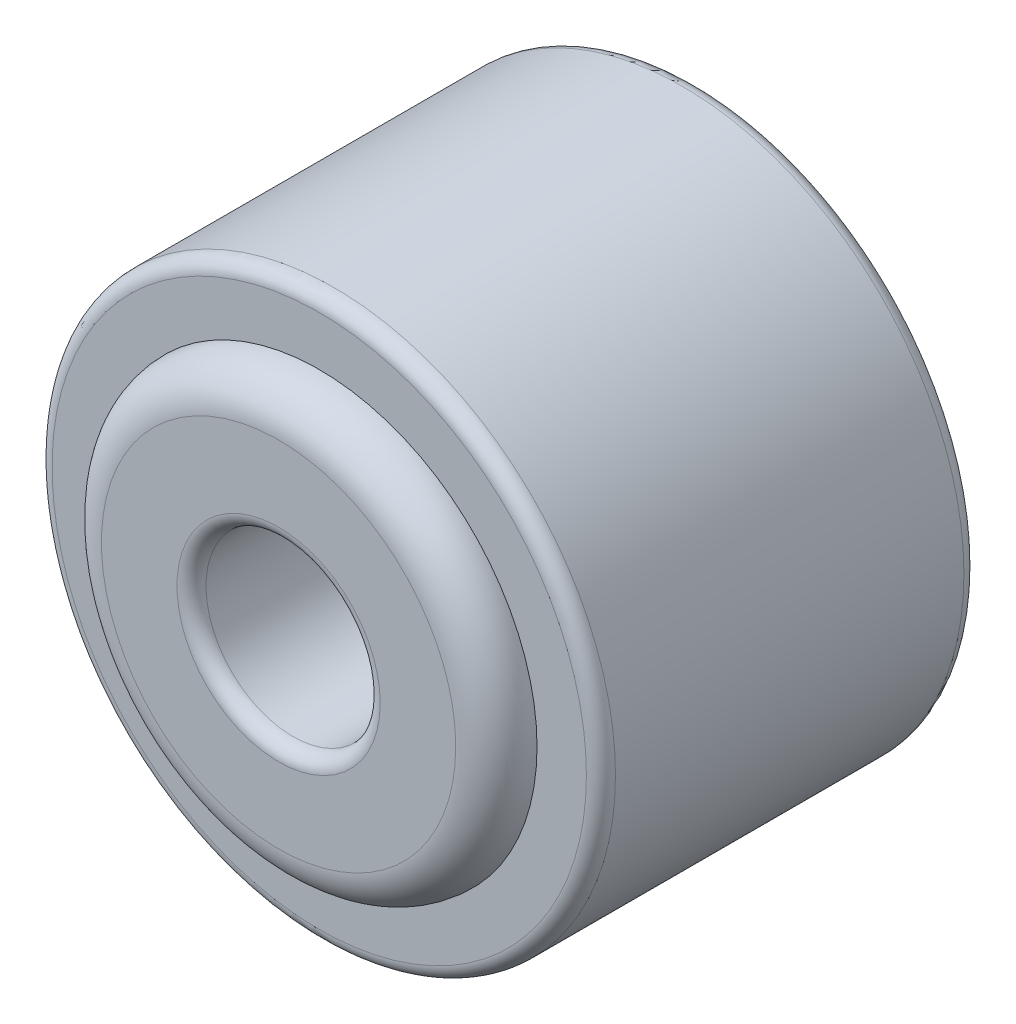
ISO-10303-21;
HEADER;
FILE_DESCRIPTION(('STEP AP214'),'2;1');
FILE_NAME('part.step','',(''),(''),'','','');
FILE_SCHEMA(('AUTOMOTIVE_DESIGN { 1 0 10303 214 1 1 1 1 }'));
ENDSEC;
DATA;
#1=APPLICATION_CONTEXT('core data for automotive mechanical design processes');
#2=APPLICATION_PROTOCOL_DEFINITION('international standard','automotive_design',2000,#1);
#3=PRODUCT_CONTEXT('',#1,'mechanical');
#4=PRODUCT('Part','Part','',(#3));
#5=PRODUCT_RELATED_PRODUCT_CATEGORY('part','',(#4));
#6=PRODUCT_DEFINITION_FORMATION('','',#4);
#7=PRODUCT_DEFINITION_CONTEXT('part definition',#1,'design');
#8=PRODUCT_DEFINITION('design','',#6,#7);
#9=PRODUCT_DEFINITION_SHAPE('','',#8);
#10=(LENGTH_UNIT() NAMED_UNIT(*) SI_UNIT(.MILLI.,.METRE.));
#11=(NAMED_UNIT(*) PLANE_ANGLE_UNIT() SI_UNIT($,.RADIAN.));
#12=(NAMED_UNIT(*) SI_UNIT($,.STERADIAN.) SOLID_ANGLE_UNIT());
#13=UNCERTAINTY_MEASURE_WITH_UNIT(LENGTH_MEASURE(1.E-05),#10,'distance_accuracy_value','');
#14=(GEOMETRIC_REPRESENTATION_CONTEXT(3) GLOBAL_UNCERTAINTY_ASSIGNED_CONTEXT((#13)) GLOBAL_UNIT_ASSIGNED_CONTEXT((#10,
#11,#12)) REPRESENTATION_CONTEXT('',''));
#15=CARTESIAN_POINT('',(0.,0.,0.));
#16=DIRECTION('',(0.,0.,1.));
#17=DIRECTION('',(1.,0.,0.));
#18=AXIS2_PLACEMENT_3D('',#15,#16,#17);
#19=CARTESIAN_POINT('',(0.,0.,1.625));
#20=DIRECTION('',(0.,0.,1.));
#21=DIRECTION('',(1.,0.,0.));
#22=AXIS2_PLACEMENT_3D('',#19,#20,#21);
#23=PLANE('',#22);
#24=CARTESIAN_POINT('',(0.,0.,1.625));
#25=DIRECTION('',(0.,0.,1.));
#26=DIRECTION('',(1.,0.,0.));
#27=AXIS2_PLACEMENT_3D('',#24,#25,#26);
#28=CIRCLE('',#27,2.3);
#29=CARTESIAN_POINT('',(2.3,0.,1.625));
#30=VERTEX_POINT('',#29);
#31=EDGE_CURVE('E10',#30,#30,#28,.T.);
#32=ORIENTED_EDGE('',*,*,#31,.T.);
#33=EDGE_LOOP('',(#32));
#34=FACE_BOUND('',#33,.T.);
#35=CARTESIAN_POINT('',(0.,0.,1.625));
#36=DIRECTION('',(0.,0.,1.));
#37=DIRECTION('',(1.,0.,0.));
#38=AXIS2_PLACEMENT_3D('',#35,#36,#37);
#39=CIRCLE('',#38,1.875);
#40=CARTESIAN_POINT('',(1.875,0.,1.625));
#41=VERTEX_POINT('',#40);
#42=EDGE_CURVE('E70',#41,#41,#39,.T.);
#43=ORIENTED_EDGE('',*,*,#42,.F.);
#44=EDGE_LOOP('',(#43));
#45=FACE_BOUND('',#44,.T.);
#46=ADVANCED_FACE('F32',(#34,#45),#23,.T.);
#47=CARTESIAN_POINT('',(0.,0.,1.625));
#48=DIRECTION('',(0.,0.,-1.));
#49=DIRECTION('',(-1.,0.,0.));
#50=AXIS2_PLACEMENT_3D('',#47,#48,#49);
#51=CYLINDRICAL_SURFACE('',#50,2.425);
#52=CARTESIAN_POINT('',(0.,0.,-1.5));
#53=DIRECTION('',(0.,0.,1.));
#54=DIRECTION('',(1.,0.,0.));
#55=AXIS2_PLACEMENT_3D('',#52,#53,#54);
#56=CIRCLE('',#55,2.425);
#57=CARTESIAN_POINT('',(-2.425,0.,-1.5));
#58=VERTEX_POINT('',#57);
#59=EDGE_CURVE('E43',#58,#58,#56,.T.);
#60=CARTESIAN_POINT('',(0.,0.,1.5));
#61=DIRECTION('',(0.,0.,1.));
#62=DIRECTION('',(1.,0.,0.));
#63=AXIS2_PLACEMENT_3D('',#60,#61,#62);
#64=CIRCLE('',#63,2.425);
#65=CARTESIAN_POINT('',(-2.425,0.,1.5));
#66=VERTEX_POINT('',#65);
#67=EDGE_CURVE('E47',#66,#66,#64,.F.);
#68=CARTESIAN_POINT('',(-2.425,0.,-1.5));
#69=CARTESIAN_POINT('',(-2.425,0.,-1.46875));
#70=CARTESIAN_POINT('',(-2.425,0.,-1.4375));
#71=CARTESIAN_POINT('',(-2.425,0.,-1.375));
#72=CARTESIAN_POINT('',(-2.425,0.,-1.34375));
#73=CARTESIAN_POINT('',(-2.425,0.,-1.28125));
#74=CARTESIAN_POINT('',(-2.425,0.,-1.25));
#75=CARTESIAN_POINT('',(-2.425,0.,-1.1875));
#76=CARTESIAN_POINT('',(-2.425,0.,-1.15625));
#77=CARTESIAN_POINT('',(-2.425,0.,-1.09375));
#78=CARTESIAN_POINT('',(-2.425,0.,-1.0625));
#79=CARTESIAN_POINT('',(-2.425,0.,-1.));
#80=CARTESIAN_POINT('',(-2.425,0.,-0.968750000000001));
#81=CARTESIAN_POINT('',(-2.425,0.,-0.906250000000001));
#82=CARTESIAN_POINT('',(-2.425,0.,-0.875000000000001));
#83=CARTESIAN_POINT('',(-2.425,0.,-0.812500000000001));
#84=CARTESIAN_POINT('',(-2.425,0.,-0.78125));
#85=CARTESIAN_POINT('',(-2.425,0.,-0.71875));
#86=CARTESIAN_POINT('',(-2.425,0.,-0.6875));
#87=CARTESIAN_POINT('',(-2.425,0.,-0.625));
#88=CARTESIAN_POINT('',(-2.425,0.,-0.59375));
#89=CARTESIAN_POINT('',(-2.425,0.,-0.53125));
#90=CARTESIAN_POINT('',(-2.425,0.,-0.500000000000001));
#91=CARTESIAN_POINT('',(-2.425,0.,-0.437500000000001));
#92=CARTESIAN_POINT('',(-2.425,0.,-0.406250000000001));
#93=CARTESIAN_POINT('',(-2.425,0.,-0.34375));
#94=CARTESIAN_POINT('',(-2.425,0.,-0.3125));
#95=CARTESIAN_POINT('',(-2.425,0.,-0.25));
#96=CARTESIAN_POINT('',(-2.425,0.,-0.218750000000001));
#97=CARTESIAN_POINT('',(-2.425,0.,-0.156250000000001));
#98=CARTESIAN_POINT('',(-2.425,0.,-0.125000000000001));
#99=CARTESIAN_POINT('',(-2.425,0.,-0.0625000000000005));
#100=CARTESIAN_POINT('',(-2.425,0.,-0.0312500000000005));
#101=CARTESIAN_POINT('',(-2.425,0.,0.0312499999999996));
#102=CARTESIAN_POINT('',(-2.425,0.,0.0624999999999996));
#103=CARTESIAN_POINT('',(-2.425,0.,0.125));
#104=CARTESIAN_POINT('',(-2.425,0.,0.15625));
#105=CARTESIAN_POINT('',(-2.425,0.,0.21875));
#106=CARTESIAN_POINT('',(-2.425,0.,0.25));
#107=CARTESIAN_POINT('',(-2.425,0.,0.3125));
#108=CARTESIAN_POINT('',(-2.425,0.,0.34375));
#109=CARTESIAN_POINT('',(-2.425,0.,0.40625));
#110=CARTESIAN_POINT('',(-2.425,0.,0.4375));
#111=CARTESIAN_POINT('',(-2.425,0.,0.5));
#112=CARTESIAN_POINT('',(-2.425,0.,0.53125));
#113=CARTESIAN_POINT('',(-2.425,0.,0.59375));
#114=CARTESIAN_POINT('',(-2.425,0.,0.625));
#115=CARTESIAN_POINT('',(-2.425,0.,0.6875));
#116=CARTESIAN_POINT('',(-2.425,0.,0.71875));
#117=CARTESIAN_POINT('',(-2.425,0.,0.78125));
#118=CARTESIAN_POINT('',(-2.425,0.,0.8125));
#119=CARTESIAN_POINT('',(-2.425,0.,0.875));
#120=CARTESIAN_POINT('',(-2.425,0.,0.90625));
#121=CARTESIAN_POINT('',(-2.425,0.,0.96875));
#122=CARTESIAN_POINT('',(-2.425,0.,1.));
#123=CARTESIAN_POINT('',(-2.425,0.,1.0625));
#124=CARTESIAN_POINT('',(-2.425,0.,1.09375));
#125=CARTESIAN_POINT('',(-2.425,0.,1.15625));
#126=CARTESIAN_POINT('',(-2.425,0.,1.1875));
#127=CARTESIAN_POINT('',(-2.425,0.,1.25));
#128=CARTESIAN_POINT('',(-2.425,0.,1.28125));
#129=CARTESIAN_POINT('',(-2.425,0.,1.34375));
#130=CARTESIAN_POINT('',(-2.425,0.,1.375));
#131=CARTESIAN_POINT('',(-2.425,0.,1.4375));
#132=CARTESIAN_POINT('',(-2.425,0.,1.46875));
#133=CARTESIAN_POINT('',(-2.425,0.,1.5));
#134=B_SPLINE_CURVE_WITH_KNOTS('',3,(#68,#69,#70,#71,#72,#73,#74,#75,#76,#77,#78,#79,#80,#81,
#82,#83,#84,#85,#86,#87,#88,#89,#90,#91,#92,#93,#94,#95,#96,#97,#98,#99,#100,#101,#102,#103,
#104,#105,#106,#107,#108,#109,#110,#111,#112,#113,#114,#115,#116,#117,#118,#119,#120,#121,#122,
#123,#124,#125,#126,#127,#128,#129,#130,#131,#132,#133),.UNSPECIFIED.,.F.,.F.,(4,2,2,2,2,2,2,2,
2,2,2,2,2,2,2,2,2,2,2,2,2,2,2,2,2,2,2,2,2,2,2,2,4),(0.,0.0937500000000001,0.1875,0.28125,0.375,
0.46875,0.5625,0.65625,0.75,0.84375,0.9375,1.03125,1.125,1.21875,1.3125,1.40625,1.5,1.59375,
1.6875,1.78125,1.875,1.96875,2.0625,2.15625,2.25,2.34375,2.4375,2.53125,2.625,2.71875,2.8125,
2.90625,3.),.UNSPECIFIED.);
#135=EDGE_CURVE('BSEAM98',#58,#66,#134,.T.);
#136=ORIENTED_EDGE('',*,*,#59,.T.);
#137=ORIENTED_EDGE('',*,*,#67,.T.);
#138=ORIENTED_EDGE('',*,*,#135,.T.);
#139=ORIENTED_EDGE('',*,*,#135,.F.);
#140=EDGE_LOOP('',(#136,#138,#137,#139));
#141=FACE_BOUND('',#140,.T.);
#142=ADVANCED_FACE('F98',(#141),#51,.T.);
#143=CARTESIAN_POINT('',(0.,0.,-1.625));
#144=DIRECTION('',(0.,0.,1.));
#145=DIRECTION('',(1.,0.,0.));
#146=AXIS2_PLACEMENT_3D('',#143,#144,#145);
#147=PLANE('',#146);
#148=CARTESIAN_POINT('',(0.,0.,-1.625));
#149=DIRECTION('',(0.,0.,1.));
#150=DIRECTION('',(1.,0.,0.));
#151=AXIS2_PLACEMENT_3D('',#148,#149,#150);
#152=CIRCLE('',#151,2.3);
#153=CARTESIAN_POINT('',(2.3,0.,-1.625));
#154=VERTEX_POINT('',#153);
#155=EDGE_CURVE('E39',#154,#154,#152,.F.);
#156=ORIENTED_EDGE('',*,*,#155,.T.);
#157=EDGE_LOOP('',(#156));
#158=FACE_BOUND('',#157,.T.);
#159=CARTESIAN_POINT('',(0.,0.,-1.625));
#160=DIRECTION('',(0.,0.,1.));
#161=DIRECTION('',(1.,0.,0.));
#162=AXIS2_PLACEMENT_3D('',#159,#160,#161);
#163=CIRCLE('',#162,1.875);
#164=CARTESIAN_POINT('',(1.875,0.,-1.625));
#165=VERTEX_POINT('',#164);
#166=EDGE_CURVE('E73',#165,#165,#163,.T.);
#167=ORIENTED_EDGE('',*,*,#166,.T.);
#168=EDGE_LOOP('',(#167));
#169=FACE_BOUND('',#168,.T.);
#170=ADVANCED_FACE('F77',(#158,#169),#147,.F.);
#171=CARTESIAN_POINT('',(0.,0.,1.975));
#172=DIRECTION('',(0.,0.,1.));
#173=DIRECTION('',(1.,0.,0.));
#174=AXIS2_PLACEMENT_3D('',#171,#172,#173);
#175=PLANE('',#174);
#176=CARTESIAN_POINT('',(0.,0.,1.975));
#177=DIRECTION('',(0.,0.,1.));
#178=DIRECTION('',(1.,0.,0.));
#179=AXIS2_PLACEMENT_3D('',#176,#177,#178);
#180=CIRCLE('',#179,0.875);
#181=CARTESIAN_POINT('',(0.875,0.,1.975));
#182=VERTEX_POINT('',#181);
#183=EDGE_CURVE('E52',#182,#182,#180,.F.);
#184=ORIENTED_EDGE('',*,*,#183,.T.);
#185=EDGE_LOOP('',(#184));
#186=FACE_BOUND('',#185,.T.);
#187=CARTESIAN_POINT('',(0.,0.,1.975));
#188=DIRECTION('',(0.,0.,1.));
#189=DIRECTION('',(1.,0.,0.));
#190=AXIS2_PLACEMENT_3D('',#187,#188,#189);
#191=CIRCLE('',#190,1.525);
#192=CARTESIAN_POINT('',(1.525,0.,1.975));
#193=VERTEX_POINT('',#192);
#194=EDGE_CURVE('E64',#193,#193,#191,.T.);
#195=ORIENTED_EDGE('',*,*,#194,.T.);
#196=EDGE_LOOP('',(#195));
#197=FACE_BOUND('',#196,.T.);
#198=ADVANCED_FACE('F92',(#186,#197),#175,.T.);
#199=CARTESIAN_POINT('',(0.,0.,-1.975));
#200=DIRECTION('',(0.,0.,-1.));
#201=DIRECTION('',(1.,0.,0.));
#202=AXIS2_PLACEMENT_3D('',#199,#200,#201);
#203=PLANE('',#202);
#204=CARTESIAN_POINT('',(0.,0.,-1.975));
#205=DIRECTION('',(0.,0.,-1.));
#206=DIRECTION('',(-1.,0.,0.));
#207=AXIS2_PLACEMENT_3D('',#204,#205,#206);
#208=CIRCLE('',#207,0.875);
#209=CARTESIAN_POINT('',(-0.875,0.,-1.975));
#210=VERTEX_POINT('',#209);
#211=EDGE_CURVE('E61',#210,#210,#208,.F.);
#212=ORIENTED_EDGE('',*,*,#211,.T.);
#213=EDGE_LOOP('',(#212));
#214=FACE_BOUND('',#213,.T.);
#215=CARTESIAN_POINT('',(0.,0.,-1.975));
#216=DIRECTION('',(0.,0.,-1.));
#217=DIRECTION('',(-1.,0.,0.));
#218=AXIS2_PLACEMENT_3D('',#215,#216,#217);
#219=CIRCLE('',#218,1.525);
#220=CARTESIAN_POINT('',(-1.525,0.,-1.975));
#221=VERTEX_POINT('',#220);
#222=EDGE_CURVE('E67',#221,#221,#219,.T.);
#223=ORIENTED_EDGE('',*,*,#222,.T.);
#224=EDGE_LOOP('',(#223));
#225=FACE_BOUND('',#224,.T.);
#226=ADVANCED_FACE('F82',(#214,#225),#203,.T.);
#227=CARTESIAN_POINT('',(0.,0.,-1.625));
#228=DIRECTION('',(0.,0.,-1.));
#229=DIRECTION('',(-1.,0.,0.));
#230=AXIS2_PLACEMENT_3D('',#227,#228,#229);
#231=TOROIDAL_SURFACE('',#230,1.525,0.35);
#232=ORIENTED_EDGE('',*,*,#222,.F.);
#233=EDGE_LOOP('',(#232));
#234=FACE_BOUND('',#233,.T.);
#235=ORIENTED_EDGE('',*,*,#166,.F.);
#236=EDGE_LOOP('',(#235));
#237=FACE_BOUND('',#236,.T.);
#238=ADVANCED_FACE('F79',(#234,#237),#231,.T.);
#239=CARTESIAN_POINT('',(0.,0.,1.625));
#240=DIRECTION('',(0.,0.,1.));
#241=DIRECTION('',(1.,0.,0.));
#242=AXIS2_PLACEMENT_3D('',#239,#240,#241);
#243=TOROIDAL_SURFACE('',#242,1.525,0.35);
#244=ORIENTED_EDGE('',*,*,#42,.T.);
#245=EDGE_LOOP('',(#244));
#246=FACE_BOUND('',#245,.T.);
#247=ORIENTED_EDGE('',*,*,#194,.F.);
#248=EDGE_LOOP('',(#247));
#249=FACE_BOUND('',#248,.T.);
#250=ADVANCED_FACE('F81',(#246,#249),#243,.T.);
#251=CARTESIAN_POINT('',(0.,0.,-1.975));
#252=DIRECTION('',(0.,0.,1.));
#253=DIRECTION('',(1.,0.,0.));
#254=AXIS2_PLACEMENT_3D('',#251,#252,#253);
#255=CYLINDRICAL_SURFACE('',#254,0.75);
#256=CARTESIAN_POINT('',(0.,0.,-1.85));
#257=DIRECTION('',(0.,0.,-1.));
#258=DIRECTION('',(-1.,0.,0.));
#259=AXIS2_PLACEMENT_3D('',#256,#257,#258);
#260=CIRCLE('',#259,0.75);
#261=CARTESIAN_POINT('',(-0.75,0.,-1.85));
#262=VERTEX_POINT('',#261);
#263=EDGE_CURVE('E55',#262,#262,#260,.T.);
#264=ORIENTED_EDGE('',*,*,#263,.T.);
#265=EDGE_LOOP('',(#264));
#266=FACE_BOUND('',#265,.T.);
#267=CARTESIAN_POINT('',(0.,0.,1.85));
#268=DIRECTION('',(0.,0.,1.));
#269=DIRECTION('',(1.,0.,0.));
#270=AXIS2_PLACEMENT_3D('',#267,#268,#269);
#271=CIRCLE('',#270,0.75);
#272=CARTESIAN_POINT('',(0.75,0.,1.85));
#273=VERTEX_POINT('',#272);
#274=EDGE_CURVE('E58',#273,#273,#271,.T.);
#275=ORIENTED_EDGE('',*,*,#274,.T.);
#276=EDGE_LOOP('',(#275));
#277=FACE_BOUND('',#276,.T.);
#278=ADVANCED_FACE('F89',(#266,#277),#255,.F.);
#279=CARTESIAN_POINT('',(0.,0.,-1.85));
#280=DIRECTION('',(0.,0.,-1.));
#281=DIRECTION('',(-1.,0.,0.));
#282=AXIS2_PLACEMENT_3D('',#279,#280,#281);
#283=TOROIDAL_SURFACE('',#282,0.875,0.125);
#284=ORIENTED_EDGE('',*,*,#263,.F.);
#285=EDGE_LOOP('',(#284));
#286=FACE_BOUND('',#285,.T.);
#287=ORIENTED_EDGE('',*,*,#211,.F.);
#288=EDGE_LOOP('',(#287));
#289=FACE_BOUND('',#288,.T.);
#290=ADVANCED_FACE('F123',(#286,#289),#283,.T.);
#291=CARTESIAN_POINT('',(0.,0.,1.85));
#292=DIRECTION('',(0.,0.,1.));
#293=DIRECTION('',(1.,0.,0.));
#294=AXIS2_PLACEMENT_3D('',#291,#292,#293);
#295=TOROIDAL_SURFACE('',#294,0.875,0.125);
#296=ORIENTED_EDGE('',*,*,#183,.F.);
#297=EDGE_LOOP('',(#296));
#298=FACE_BOUND('',#297,.T.);
#299=ORIENTED_EDGE('',*,*,#274,.F.);
#300=EDGE_LOOP('',(#299));
#301=FACE_BOUND('',#300,.T.);
#302=ADVANCED_FACE('F119',(#298,#301),#295,.T.);
#303=CARTESIAN_POINT('',(0.,0.,-1.5));
#304=DIRECTION('',(0.,0.,1.));
#305=DIRECTION('',(1.,0.,0.));
#306=AXIS2_PLACEMENT_3D('',#303,#304,#305);
#307=TOROIDAL_SURFACE('',#306,2.3,0.125);
#308=ORIENTED_EDGE('',*,*,#155,.F.);
#309=EDGE_LOOP('',(#308));
#310=FACE_BOUND('',#309,.T.);
#311=ORIENTED_EDGE('',*,*,#59,.F.);
#312=EDGE_LOOP('',(#311));
#313=FACE_BOUND('',#312,.T.);
#314=ADVANCED_FACE('F122',(#310,#313),#307,.T.);
#315=CARTESIAN_POINT('',(0.,0.,1.5));
#316=DIRECTION('',(0.,0.,1.));
#317=DIRECTION('',(1.,0.,0.));
#318=AXIS2_PLACEMENT_3D('',#315,#316,#317);
#319=TOROIDAL_SURFACE('',#318,2.3,0.125);
#320=ORIENTED_EDGE('',*,*,#67,.F.);
#321=EDGE_LOOP('',(#320));
#322=FACE_BOUND('',#321,.T.);
#323=ORIENTED_EDGE('',*,*,#31,.F.);
#324=EDGE_LOOP('',(#323));
#325=FACE_BOUND('',#324,.T.);
#326=ADVANCED_FACE('F34',(#322,#325),#319,.T.);
#327=CLOSED_SHELL('',(#46,#142,#170,#198,#226,#238,#250,#278,#290,#302,#314,#326));
#328=MANIFOLD_SOLID_BREP('B2',#327);
#329=ADVANCED_BREP_SHAPE_REPRESENTATION('',(#18,#328),#14);
#330=SHAPE_DEFINITION_REPRESENTATION(#9,#329);
ENDSEC;
END-ISO-10303-21;
